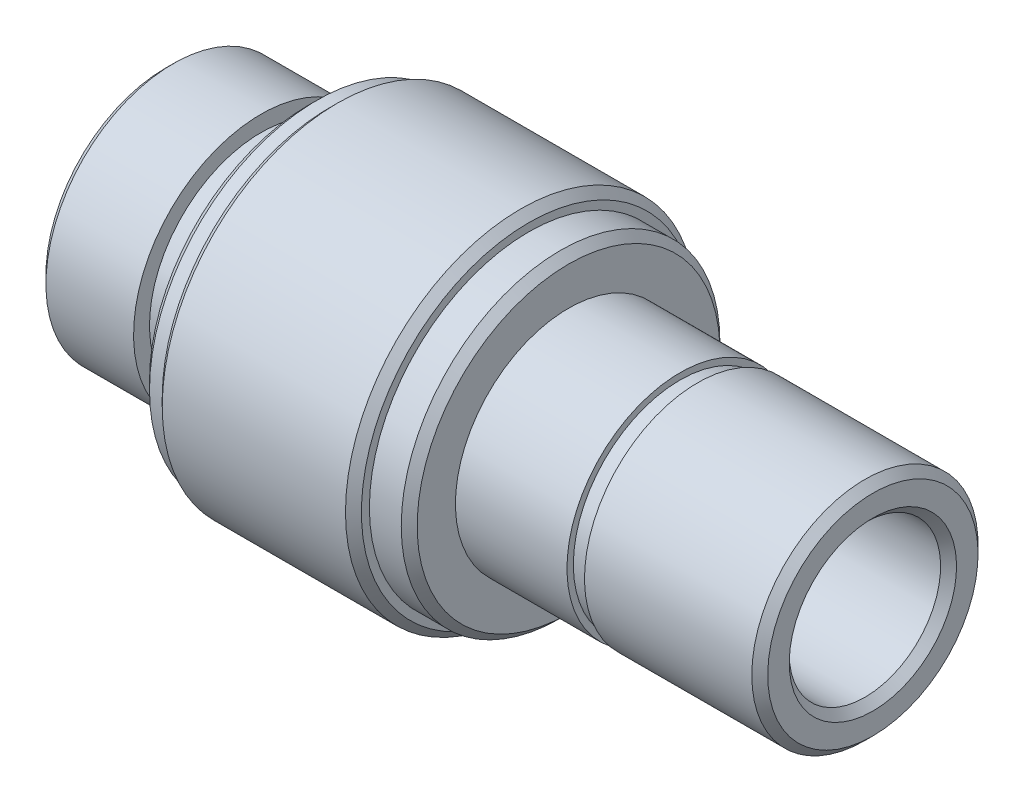
ISO-10303-21;
HEADER;
FILE_DESCRIPTION(('STEP AP214'),'2;1');
FILE_NAME('part.step','',(''),(''),'','','');
FILE_SCHEMA(('AUTOMOTIVE_DESIGN { 1 0 10303 214 1 1 1 1 }'));
ENDSEC;
DATA;
#1=APPLICATION_CONTEXT('core data for automotive mechanical design processes');
#2=APPLICATION_PROTOCOL_DEFINITION('international standard','automotive_design',2000,#1);
#3=PRODUCT_CONTEXT('',#1,'mechanical');
#4=PRODUCT('Part','Part','',(#3));
#5=PRODUCT_RELATED_PRODUCT_CATEGORY('part','',(#4));
#6=PRODUCT_DEFINITION_FORMATION('','',#4);
#7=PRODUCT_DEFINITION_CONTEXT('part definition',#1,'design');
#8=PRODUCT_DEFINITION('design','',#6,#7);
#9=PRODUCT_DEFINITION_SHAPE('','',#8);
#10=(LENGTH_UNIT() NAMED_UNIT(*) SI_UNIT(.MILLI.,.METRE.));
#11=(NAMED_UNIT(*) PLANE_ANGLE_UNIT() SI_UNIT($,.RADIAN.));
#12=(NAMED_UNIT(*) SI_UNIT($,.STERADIAN.) SOLID_ANGLE_UNIT());
#13=UNCERTAINTY_MEASURE_WITH_UNIT(LENGTH_MEASURE(1.E-05),#10,'distance_accuracy_value','');
#14=(GEOMETRIC_REPRESENTATION_CONTEXT(3) GLOBAL_UNCERTAINTY_ASSIGNED_CONTEXT((#13)) GLOBAL_UNIT_ASSIGNED_CONTEXT((#10,
#11,#12)) REPRESENTATION_CONTEXT('',''));
#15=CARTESIAN_POINT('',(0.,0.,0.));
#16=DIRECTION('',(0.,0.,1.));
#17=DIRECTION('',(1.,0.,0.));
#18=AXIS2_PLACEMENT_3D('',#15,#16,#17);
#19=CARTESIAN_POINT('',(-50.049857,-13.516816,0.));
#20=DIRECTION('',(-1.,0.,0.));
#21=DIRECTION('',(0.,-1.,0.));
#22=AXIS2_PLACEMENT_3D('',#19,#20,#21);
#23=CYLINDRICAL_SURFACE('',#22,6.7);
#24=CARTESIAN_POINT('',(-17.749857,-13.516816,0.));
#25=DIRECTION('',(-1.,0.,0.));
#26=DIRECTION('',(0.,-1.,0.));
#27=AXIS2_PLACEMENT_3D('',#24,#25,#26);
#28=CIRCLE('',#27,6.7);
#29=CARTESIAN_POINT('',(-17.749857,-20.216816,0.));
#30=VERTEX_POINT('',#29);
#31=EDGE_CURVE('E77',#30,#30,#28,.T.);
#32=ORIENTED_EDGE('',*,*,#31,.F.);
#33=EDGE_LOOP('',(#32));
#34=FACE_BOUND('',#33,.T.);
#35=CARTESIAN_POINT('',(-16.649857,-13.516816,0.));
#36=DIRECTION('',(-1.,0.,0.));
#37=DIRECTION('',(0.,-1.,0.));
#38=AXIS2_PLACEMENT_3D('',#35,#36,#37);
#39=CIRCLE('',#38,6.7);
#40=CARTESIAN_POINT('',(-16.649857,-20.216816,0.));
#41=VERTEX_POINT('',#40);
#42=EDGE_CURVE('E107',#41,#41,#39,.T.);
#43=ORIENTED_EDGE('',*,*,#42,.T.);
#44=EDGE_LOOP('',(#43));
#45=FACE_BOUND('',#44,.T.);
#46=ADVANCED_FACE('F31',(#34,#45),#23,.T.);
#47=CARTESIAN_POINT('',(-17.749857,-43.7374138503609,0.));
#48=DIRECTION('',(-1.,0.,0.));
#49=DIRECTION('',(0.,-1.,0.));
#50=AXIS2_PLACEMENT_3D('',#47,#48,#49);
#51=PLANE('',#50);
#52=CARTESIAN_POINT('',(-17.749857,-13.516816,0.));
#53=DIRECTION('',(-1.,0.,0.));
#54=DIRECTION('',(0.,-1.,0.));
#55=AXIS2_PLACEMENT_3D('',#52,#53,#54);
#56=CIRCLE('',#55,7.1);
#57=CARTESIAN_POINT('',(-17.749857,-20.616816,0.));
#58=VERTEX_POINT('',#57);
#59=EDGE_CURVE('E80',#58,#58,#56,.T.);
#60=ORIENTED_EDGE('',*,*,#59,.F.);
#61=EDGE_LOOP('',(#60));
#62=FACE_BOUND('',#61,.T.);
#63=ORIENTED_EDGE('',*,*,#31,.T.);
#64=EDGE_LOOP('',(#63));
#65=FACE_BOUND('',#64,.T.);
#66=ADVANCED_FACE('F131',(#62,#65),#51,.F.);
#67=CARTESIAN_POINT('',(-50.049857,-13.516816,0.));
#68=DIRECTION('',(-1.,0.,0.));
#69=DIRECTION('',(0.,-1.,0.));
#70=AXIS2_PLACEMENT_3D('',#67,#68,#69);
#71=CYLINDRICAL_SURFACE('',#70,7.10000000000001);
#72=CARTESIAN_POINT('',(-24.749857,-13.516816,0.));
#73=DIRECTION('',(-1.,0.,0.));
#74=DIRECTION('',(0.,-1.,0.));
#75=AXIS2_PLACEMENT_3D('',#72,#73,#74);
#76=CIRCLE('',#75,7.10000000000001);
#77=CARTESIAN_POINT('',(-24.749857,-20.616816,0.));
#78=VERTEX_POINT('',#77);
#79=EDGE_CURVE('E83',#78,#78,#76,.T.);
#80=ORIENTED_EDGE('',*,*,#79,.F.);
#81=EDGE_LOOP('',(#80));
#82=FACE_BOUND('',#81,.T.);
#83=ORIENTED_EDGE('',*,*,#59,.T.);
#84=EDGE_LOOP('',(#83));
#85=FACE_BOUND('',#84,.T.);
#86=ADVANCED_FACE('F136',(#82,#85),#71,.T.);
#87=CARTESIAN_POINT('',(-24.749857,-43.7374138503609,0.));
#88=DIRECTION('',(1.,0.,0.));
#89=DIRECTION('',(0.,1.,0.));
#90=AXIS2_PLACEMENT_3D('',#87,#88,#89);
#91=PLANE('',#90);
#92=CARTESIAN_POINT('',(-24.749857,-13.516816,0.));
#93=DIRECTION('',(1.,0.,0.));
#94=DIRECTION('',(0.,1.,0.));
#95=AXIS2_PLACEMENT_3D('',#92,#93,#94);
#96=CIRCLE('',#95,9.5);
#97=CARTESIAN_POINT('',(-24.749857,-4.016816,0.));
#98=VERTEX_POINT('',#97);
#99=EDGE_CURVE('E10',#98,#98,#96,.T.);
#100=ORIENTED_EDGE('',*,*,#99,.T.);
#101=EDGE_LOOP('',(#100));
#102=FACE_BOUND('',#101,.T.);
#103=ORIENTED_EDGE('',*,*,#79,.T.);
#104=EDGE_LOOP('',(#103));
#105=FACE_BOUND('',#104,.T.);
#106=ADVANCED_FACE('F143',(#102,#105),#91,.T.);
#107=CARTESIAN_POINT('',(-50.049857,-13.516816,0.));
#108=DIRECTION('',(-1.,0.,0.));
#109=DIRECTION('',(0.,-1.,0.));
#110=AXIS2_PLACEMENT_3D('',#107,#108,#109);
#111=CYLINDRICAL_SURFACE('',#110,10.);
#112=CARTESIAN_POINT('',(-25.249857,-13.516816,0.));
#113=DIRECTION('',(1.,0.,0.));
#114=DIRECTION('',(0.,0.,-1.));
#115=AXIS2_PLACEMENT_3D('',#112,#113,#114);
#116=CIRCLE('',#115,10.);
#117=CARTESIAN_POINT('',(-25.249857,-13.516816,-10.));
#118=VERTEX_POINT('',#117);
#119=EDGE_CURVE('E37',#118,#118,#116,.F.);
#120=ORIENTED_EDGE('',*,*,#119,.T.);
#121=EDGE_LOOP('',(#120));
#122=FACE_BOUND('',#121,.T.);
#123=CARTESIAN_POINT('',(-27.249857,-13.516816,0.));
#124=DIRECTION('',(-1.,0.,0.));
#125=DIRECTION('',(0.,-1.,0.));
#126=AXIS2_PLACEMENT_3D('',#123,#124,#125);
#127=CIRCLE('',#126,10.);
#128=CARTESIAN_POINT('',(-27.249857,-23.516816,0.));
#129=VERTEX_POINT('',#128);
#130=EDGE_CURVE('E86',#129,#129,#127,.T.);
#131=ORIENTED_EDGE('',*,*,#130,.F.);
#132=EDGE_LOOP('',(#131));
#133=FACE_BOUND('',#132,.T.);
#134=ADVANCED_FACE('F150',(#122,#133),#111,.T.);
#135=CARTESIAN_POINT('',(-27.249857,-43.7374138503609,0.));
#136=DIRECTION('',(-1.,0.,0.));
#137=DIRECTION('',(0.,-1.,0.));
#138=AXIS2_PLACEMENT_3D('',#135,#136,#137);
#139=PLANE('',#138);
#140=CARTESIAN_POINT('',(-27.249857,-13.516816,0.));
#141=DIRECTION('',(-1.,0.,0.));
#142=DIRECTION('',(0.,-1.,0.));
#143=AXIS2_PLACEMENT_3D('',#140,#141,#142);
#144=CIRCLE('',#143,10.5);
#145=CARTESIAN_POINT('',(-27.249857,-24.016816,0.));
#146=VERTEX_POINT('',#145);
#147=EDGE_CURVE('E71',#146,#146,#144,.F.);
#148=ORIENTED_EDGE('',*,*,#147,.T.);
#149=EDGE_LOOP('',(#148));
#150=FACE_BOUND('',#149,.T.);
#151=ORIENTED_EDGE('',*,*,#130,.T.);
#152=EDGE_LOOP('',(#151));
#153=FACE_BOUND('',#152,.T.);
#154=ADVANCED_FACE('F153',(#150,#153),#139,.F.);
#155=CARTESIAN_POINT('',(-50.049857,-13.516816,0.));
#156=DIRECTION('',(-1.,0.,0.));
#157=DIRECTION('',(0.,-1.,0.));
#158=AXIS2_PLACEMENT_3D('',#155,#156,#157);
#159=CYLINDRICAL_SURFACE('',#158,11.);
#160=CARTESIAN_POINT('',(-27.749857,-13.516816,0.));
#161=DIRECTION('',(-1.,0.,0.));
#162=DIRECTION('',(0.,0.,1.));
#163=AXIS2_PLACEMENT_3D('',#160,#161,#162);
#164=CIRCLE('',#163,11.);
#165=CARTESIAN_POINT('',(-27.749857,-13.516816,11.));
#166=VERTEX_POINT('',#165);
#167=EDGE_CURVE('E74',#166,#166,#164,.T.);
#168=ORIENTED_EDGE('',*,*,#167,.T.);
#169=EDGE_LOOP('',(#168));
#170=FACE_BOUND('',#169,.T.);
#171=CARTESIAN_POINT('',(-39.249857,-13.516816,0.));
#172=DIRECTION('',(-1.,0.,0.));
#173=DIRECTION('',(0.,-1.,0.));
#174=AXIS2_PLACEMENT_3D('',#171,#172,#173);
#175=CIRCLE('',#174,11.);
#176=CARTESIAN_POINT('',(-39.249857,-24.516816,0.));
#177=VERTEX_POINT('',#176);
#178=EDGE_CURVE('E89',#177,#177,#175,.T.);
#179=ORIENTED_EDGE('',*,*,#178,.F.);
#180=EDGE_LOOP('',(#179));
#181=FACE_BOUND('',#180,.T.);
#182=ADVANCED_FACE('F156',(#170,#181),#159,.T.);
#183=CARTESIAN_POINT('',(-50.049857,-13.516816,0.));
#184=DIRECTION('',(-1.,0.,0.));
#185=DIRECTION('',(0.,-1.,0.));
#186=AXIS2_PLACEMENT_3D('',#183,#184,#185);
#187=CYLINDRICAL_SURFACE('',#186,10.5);
#188=CARTESIAN_POINT('',(-40.549857,-13.516816,0.));
#189=DIRECTION('',(-1.,0.,0.));
#190=DIRECTION('',(0.,0.,1.));
#191=AXIS2_PLACEMENT_3D('',#188,#189,#190);
#192=CIRCLE('',#191,10.5);
#193=CARTESIAN_POINT('',(-40.549857,-13.516816,10.5));
#194=VERTEX_POINT('',#193);
#195=EDGE_CURVE('E62',#194,#194,#192,.F.);
#196=ORIENTED_EDGE('',*,*,#195,.T.);
#197=EDGE_LOOP('',(#196));
#198=FACE_BOUND('',#197,.T.);
#199=CARTESIAN_POINT('',(-39.749857,-13.516816,0.));
#200=DIRECTION('',(1.,0.,0.));
#201=DIRECTION('',(0.,0.,-1.));
#202=AXIS2_PLACEMENT_3D('',#199,#200,#201);
#203=CIRCLE('',#202,10.5);
#204=CARTESIAN_POINT('',(-39.749857,-13.516816,-10.5));
#205=VERTEX_POINT('',#204);
#206=EDGE_CURVE('E65',#205,#205,#203,.F.);
#207=ORIENTED_EDGE('',*,*,#206,.T.);
#208=EDGE_LOOP('',(#207));
#209=FACE_BOUND('',#208,.T.);
#210=ADVANCED_FACE('F160',(#198,#209),#187,.T.);
#211=CARTESIAN_POINT('',(-41.049857,-43.7374138503609,0.));
#212=DIRECTION('',(-1.,0.,0.));
#213=DIRECTION('',(0.,-1.,0.));
#214=AXIS2_PLACEMENT_3D('',#211,#212,#213);
#215=PLANE('',#214);
#216=CARTESIAN_POINT('',(-41.049857,-13.516816,0.));
#217=DIRECTION('',(-1.,0.,0.));
#218=DIRECTION('',(0.,-1.,0.));
#219=AXIS2_PLACEMENT_3D('',#216,#217,#218);
#220=CIRCLE('',#219,10.);
#221=CARTESIAN_POINT('',(-41.049857,-23.516816,0.));
#222=VERTEX_POINT('',#221);
#223=EDGE_CURVE('E68',#222,#222,#220,.T.);
#224=ORIENTED_EDGE('',*,*,#223,.T.);
#225=EDGE_LOOP('',(#224));
#226=FACE_BOUND('',#225,.T.);
#227=CARTESIAN_POINT('',(-41.049857,-13.516816,0.));
#228=DIRECTION('',(-1.,0.,0.));
#229=DIRECTION('',(0.,-1.,0.));
#230=AXIS2_PLACEMENT_3D('',#227,#228,#229);
#231=CIRCLE('',#230,7.);
#232=CARTESIAN_POINT('',(-41.049857,-20.516816,0.));
#233=VERTEX_POINT('',#232);
#234=EDGE_CURVE('E92',#233,#233,#231,.T.);
#235=ORIENTED_EDGE('',*,*,#234,.F.);
#236=EDGE_LOOP('',(#235));
#237=FACE_BOUND('',#236,.T.);
#238=ADVANCED_FACE('F164',(#226,#237),#215,.T.);
#239=CARTESIAN_POINT('',(-50.049857,-13.516816,0.));
#240=DIRECTION('',(-1.,0.,0.));
#241=DIRECTION('',(0.,-1.,0.));
#242=AXIS2_PLACEMENT_3D('',#239,#240,#241);
#243=CYLINDRICAL_SURFACE('',#242,7.);
#244=ORIENTED_EDGE('',*,*,#234,.T.);
#245=EDGE_LOOP('',(#244));
#246=FACE_BOUND('',#245,.T.);
#247=CARTESIAN_POINT('',(-44.049857,-13.516816,0.));
#248=DIRECTION('',(-1.,0.,0.));
#249=DIRECTION('',(0.,-1.,0.));
#250=AXIS2_PLACEMENT_3D('',#247,#248,#249);
#251=CIRCLE('',#250,7.);
#252=CARTESIAN_POINT('',(-44.049857,-20.516816,0.));
#253=VERTEX_POINT('',#252);
#254=EDGE_CURVE('E95',#253,#253,#251,.T.);
#255=ORIENTED_EDGE('',*,*,#254,.F.);
#256=EDGE_LOOP('',(#255));
#257=FACE_BOUND('',#256,.T.);
#258=ADVANCED_FACE('F168',(#246,#257),#243,.T.);
#259=CARTESIAN_POINT('',(-44.049857,-43.7374138503609,0.));
#260=DIRECTION('',(1.,0.,0.));
#261=DIRECTION('',(0.,1.,0.));
#262=AXIS2_PLACEMENT_3D('',#259,#260,#261);
#263=PLANE('',#262);
#264=ORIENTED_EDGE('',*,*,#254,.T.);
#265=EDGE_LOOP('',(#264));
#266=FACE_BOUND('',#265,.T.);
#267=CARTESIAN_POINT('',(-44.049857,-13.516816,0.));
#268=DIRECTION('',(-1.,0.,0.));
#269=DIRECTION('',(0.,-1.,0.));
#270=AXIS2_PLACEMENT_3D('',#267,#268,#269);
#271=CIRCLE('',#270,7.99999999999999);
#272=CARTESIAN_POINT('',(-44.049857,-21.516816,0.));
#273=VERTEX_POINT('',#272);
#274=EDGE_CURVE('E98',#273,#273,#271,.T.);
#275=ORIENTED_EDGE('',*,*,#274,.F.);
#276=EDGE_LOOP('',(#275));
#277=FACE_BOUND('',#276,.T.);
#278=ADVANCED_FACE('F172',(#266,#277),#263,.T.);
#279=CARTESIAN_POINT('',(-50.049857,-13.516816,0.));
#280=DIRECTION('',(-1.,0.,0.));
#281=DIRECTION('',(0.,-1.,0.));
#282=AXIS2_PLACEMENT_3D('',#279,#280,#281);
#283=CYLINDRICAL_SURFACE('',#282,8.);
#284=CARTESIAN_POINT('',(-49.549857,-13.516816,0.));
#285=DIRECTION('',(1.,0.,0.));
#286=DIRECTION('',(0.,0.,-1.));
#287=AXIS2_PLACEMENT_3D('',#284,#285,#286);
#288=CIRCLE('',#287,8.);
#289=CARTESIAN_POINT('',(-49.549857,-13.516816,-8.));
#290=VERTEX_POINT('',#289);
#291=EDGE_CURVE('E41',#290,#290,#288,.T.);
#292=ORIENTED_EDGE('',*,*,#291,.T.);
#293=EDGE_LOOP('',(#292));
#294=FACE_BOUND('',#293,.T.);
#295=ORIENTED_EDGE('',*,*,#274,.T.);
#296=EDGE_LOOP('',(#295));
#297=FACE_BOUND('',#296,.T.);
#298=ADVANCED_FACE('F176',(#294,#297),#283,.T.);
#299=CARTESIAN_POINT('',(-50.049857,-43.7374138503609,0.));
#300=DIRECTION('',(1.,0.,0.));
#301=DIRECTION('',(0.,1.,0.));
#302=AXIS2_PLACEMENT_3D('',#299,#300,#301);
#303=PLANE('',#302);
#304=CARTESIAN_POINT('',(-50.049857,-13.516816,0.));
#305=DIRECTION('',(1.,0.,0.));
#306=DIRECTION('',(0.,1.,0.));
#307=AXIS2_PLACEMENT_3D('',#304,#305,#306);
#308=CIRCLE('',#307,7.49999999999999);
#309=CARTESIAN_POINT('',(-50.049857,-6.016816,0.));
#310=VERTEX_POINT('',#309);
#311=EDGE_CURVE('E45',#310,#310,#308,.F.);
#312=ORIENTED_EDGE('',*,*,#311,.T.);
#313=EDGE_LOOP('',(#312));
#314=FACE_BOUND('',#313,.T.);
#315=CARTESIAN_POINT('',(-50.049857,-13.516816,0.));
#316=DIRECTION('',(-1.,0.,0.));
#317=DIRECTION('',(0.,-1.,0.));
#318=AXIS2_PLACEMENT_3D('',#315,#316,#317);
#319=CIRCLE('',#318,4.75000000000001);
#320=CARTESIAN_POINT('',(-50.049857,-18.266816,0.));
#321=VERTEX_POINT('',#320);
#322=EDGE_CURVE('E101',#321,#321,#319,.T.);
#323=ORIENTED_EDGE('',*,*,#322,.F.);
#324=EDGE_LOOP('',(#323));
#325=FACE_BOUND('',#324,.T.);
#326=ADVANCED_FACE('F180',(#314,#325),#303,.F.);
#327=CARTESIAN_POINT('',(-50.049857,-13.516816,0.));
#328=DIRECTION('',(-1.,0.,0.));
#329=DIRECTION('',(0.,-1.,0.));
#330=AXIS2_PLACEMENT_3D('',#327,#328,#329);
#331=CYLINDRICAL_SURFACE('',#330,4.75);
#332=CARTESIAN_POINT('',(-6.149857,-13.516816,0.));
#333=DIRECTION('',(-1.,0.,0.));
#334=DIRECTION('',(0.,0.,1.));
#335=AXIS2_PLACEMENT_3D('',#332,#333,#334);
#336=CIRCLE('',#335,4.75);
#337=CARTESIAN_POINT('',(-6.149857,-13.516816,4.75));
#338=VERTEX_POINT('',#337);
#339=EDGE_CURVE('E53',#338,#338,#336,.F.);
#340=ORIENTED_EDGE('',*,*,#339,.T.);
#341=EDGE_LOOP('',(#340));
#342=FACE_BOUND('',#341,.T.);
#343=ORIENTED_EDGE('',*,*,#322,.T.);
#344=EDGE_LOOP('',(#343));
#345=FACE_BOUND('',#344,.T.);
#346=ADVANCED_FACE('F127',(#342,#345),#331,.F.);
#347=CARTESIAN_POINT('',(-5.64985699999999,-43.7374138503609,0.));
#348=DIRECTION('',(-1.,0.,0.));
#349=DIRECTION('',(0.,-1.,0.));
#350=AXIS2_PLACEMENT_3D('',#347,#348,#349);
#351=PLANE('',#350);
#352=CARTESIAN_POINT('',(-5.649857,-13.516816,0.));
#353=DIRECTION('',(-1.,0.,0.));
#354=DIRECTION('',(0.,-1.,0.));
#355=AXIS2_PLACEMENT_3D('',#352,#353,#354);
#356=CIRCLE('',#355,5.25);
#357=CARTESIAN_POINT('',(-5.649857,-18.766816,0.));
#358=VERTEX_POINT('',#357);
#359=EDGE_CURVE('E56',#358,#358,#356,.T.);
#360=ORIENTED_EDGE('',*,*,#359,.T.);
#361=EDGE_LOOP('',(#360));
#362=FACE_BOUND('',#361,.T.);
#363=CARTESIAN_POINT('',(-5.649857,-13.516816,0.));
#364=DIRECTION('',(-1.,0.,0.));
#365=DIRECTION('',(0.,-1.,0.));
#366=AXIS2_PLACEMENT_3D('',#363,#364,#365);
#367=CIRCLE('',#366,6.59999999999999);
#368=CARTESIAN_POINT('',(-5.649857,-20.116816,0.));
#369=VERTEX_POINT('',#368);
#370=EDGE_CURVE('E59',#369,#369,#367,.F.);
#371=ORIENTED_EDGE('',*,*,#370,.T.);
#372=EDGE_LOOP('',(#371));
#373=FACE_BOUND('',#372,.T.);
#374=ADVANCED_FACE('F121',(#362,#373),#351,.F.);
#375=CARTESIAN_POINT('',(-50.049857,-13.516816,0.));
#376=DIRECTION('',(-1.,0.,0.));
#377=DIRECTION('',(0.,-1.,0.));
#378=AXIS2_PLACEMENT_3D('',#375,#376,#377);
#379=CYLINDRICAL_SURFACE('',#378,7.1);
#380=CARTESIAN_POINT('',(-6.149857,-13.516816,0.));
#381=DIRECTION('',(-1.,0.,0.));
#382=DIRECTION('',(0.,0.,1.));
#383=AXIS2_PLACEMENT_3D('',#380,#381,#382);
#384=CIRCLE('',#383,7.1);
#385=CARTESIAN_POINT('',(-6.149857,-13.516816,7.1));
#386=VERTEX_POINT('',#385);
#387=EDGE_CURVE('E50',#386,#386,#384,.T.);
#388=ORIENTED_EDGE('',*,*,#387,.T.);
#389=EDGE_LOOP('',(#388));
#390=FACE_BOUND('',#389,.T.);
#391=CARTESIAN_POINT('',(-16.649857,-13.516816,0.));
#392=DIRECTION('',(-1.,0.,0.));
#393=DIRECTION('',(0.,-1.,0.));
#394=AXIS2_PLACEMENT_3D('',#391,#392,#393);
#395=CIRCLE('',#394,7.1);
#396=CARTESIAN_POINT('',(-16.649857,-20.616816,0.));
#397=VERTEX_POINT('',#396);
#398=EDGE_CURVE('E104',#397,#397,#395,.T.);
#399=ORIENTED_EDGE('',*,*,#398,.F.);
#400=EDGE_LOOP('',(#399));
#401=FACE_BOUND('',#400,.T.);
#402=ADVANCED_FACE('F116',(#390,#401),#379,.T.);
#403=CARTESIAN_POINT('',(-16.649857,-43.7374138503609,0.));
#404=DIRECTION('',(1.,0.,0.));
#405=DIRECTION('',(0.,1.,0.));
#406=AXIS2_PLACEMENT_3D('',#403,#404,#405);
#407=PLANE('',#406);
#408=ORIENTED_EDGE('',*,*,#42,.F.);
#409=EDGE_LOOP('',(#408));
#410=FACE_BOUND('',#409,.T.);
#411=ORIENTED_EDGE('',*,*,#398,.T.);
#412=EDGE_LOOP('',(#411));
#413=FACE_BOUND('',#412,.T.);
#414=ADVANCED_FACE('F112',(#410,#413),#407,.F.);
#415=CARTESIAN_POINT('',(-27.749857,-13.516816,0.));
#416=DIRECTION('',(-1.,0.,0.));
#417=DIRECTION('',(0.,0.,1.));
#418=AXIS2_PLACEMENT_3D('',#415,#416,#417);
#419=CONICAL_SURFACE('',#418,11.,0.785398163397445);
#420=ORIENTED_EDGE('',*,*,#147,.F.);
#421=EDGE_LOOP('',(#420));
#422=FACE_BOUND('',#421,.T.);
#423=ORIENTED_EDGE('',*,*,#167,.F.);
#424=EDGE_LOOP('',(#423));
#425=FACE_BOUND('',#424,.T.);
#426=ADVANCED_FACE('F115',(#422,#425),#419,.T.);
#427=CARTESIAN_POINT('',(-41.049857,-13.516816,0.));
#428=DIRECTION('',(1.,0.,0.));
#429=DIRECTION('',(0.,0.,-1.));
#430=AXIS2_PLACEMENT_3D('',#427,#428,#429);
#431=CONICAL_SURFACE('',#430,9.99999999999999,0.785398163397447);
#432=ORIENTED_EDGE('',*,*,#195,.F.);
#433=EDGE_LOOP('',(#432));
#434=FACE_BOUND('',#433,.T.);
#435=ORIENTED_EDGE('',*,*,#223,.F.);
#436=EDGE_LOOP('',(#435));
#437=FACE_BOUND('',#436,.T.);
#438=ADVANCED_FACE('F219',(#434,#437),#431,.T.);
#439=CARTESIAN_POINT('',(-39.749857,-13.516816,0.));
#440=DIRECTION('',(1.,0.,0.));
#441=DIRECTION('',(0.,0.,-1.));
#442=AXIS2_PLACEMENT_3D('',#439,#440,#441);
#443=CONICAL_SURFACE('',#442,10.5,0.78539816339745);
#444=ORIENTED_EDGE('',*,*,#178,.T.);
#445=EDGE_LOOP('',(#444));
#446=FACE_BOUND('',#445,.T.);
#447=ORIENTED_EDGE('',*,*,#206,.F.);
#448=EDGE_LOOP('',(#447));
#449=FACE_BOUND('',#448,.T.);
#450=ADVANCED_FACE('F198',(#446,#449),#443,.T.);
#451=CARTESIAN_POINT('',(-5.649857,-13.516816,0.));
#452=DIRECTION('',(1.,0.,0.));
#453=DIRECTION('',(0.,0.,-1.));
#454=AXIS2_PLACEMENT_3D('',#451,#452,#453);
#455=CONICAL_SURFACE('',#454,5.25,0.785398163397445);
#456=ORIENTED_EDGE('',*,*,#339,.F.);
#457=EDGE_LOOP('',(#456));
#458=FACE_BOUND('',#457,.T.);
#459=ORIENTED_EDGE('',*,*,#359,.F.);
#460=EDGE_LOOP('',(#459));
#461=FACE_BOUND('',#460,.T.);
#462=ADVANCED_FACE('F194',(#458,#461),#455,.F.);
#463=CARTESIAN_POINT('',(-6.149857,-13.516816,0.));
#464=DIRECTION('',(-1.,0.,0.));
#465=DIRECTION('',(0.,0.,1.));
#466=AXIS2_PLACEMENT_3D('',#463,#464,#465);
#467=CONICAL_SURFACE('',#466,7.1,0.785398163397449);
#468=ORIENTED_EDGE('',*,*,#370,.F.);
#469=EDGE_LOOP('',(#468));
#470=FACE_BOUND('',#469,.T.);
#471=ORIENTED_EDGE('',*,*,#387,.F.);
#472=EDGE_LOOP('',(#471));
#473=FACE_BOUND('',#472,.T.);
#474=ADVANCED_FACE('F197',(#470,#473),#467,.T.);
#475=CARTESIAN_POINT('',(-50.049857,-13.516816,0.));
#476=DIRECTION('',(1.,0.,0.));
#477=DIRECTION('',(0.,0.,-1.));
#478=AXIS2_PLACEMENT_3D('',#475,#476,#477);
#479=CONICAL_SURFACE('',#478,7.49999999999999,0.785398163397452);
#480=ORIENTED_EDGE('',*,*,#291,.F.);
#481=EDGE_LOOP('',(#480));
#482=FACE_BOUND('',#481,.T.);
#483=ORIENTED_EDGE('',*,*,#311,.F.);
#484=EDGE_LOOP('',(#483));
#485=FACE_BOUND('',#484,.T.);
#486=ADVANCED_FACE('F206',(#482,#485),#479,.T.);
#487=CARTESIAN_POINT('',(-25.249857,-13.516816,0.));
#488=DIRECTION('',(-1.,0.,0.));
#489=DIRECTION('',(0.,0.,1.));
#490=AXIS2_PLACEMENT_3D('',#487,#488,#489);
#491=CONICAL_SURFACE('',#490,10.,0.785398163397448);
#492=ORIENTED_EDGE('',*,*,#99,.F.);
#493=EDGE_LOOP('',(#492));
#494=FACE_BOUND('',#493,.T.);
#495=ORIENTED_EDGE('',*,*,#119,.F.);
#496=EDGE_LOOP('',(#495));
#497=FACE_BOUND('',#496,.T.);
#498=ADVANCED_FACE('F212',(#494,#497),#491,.T.);
#499=CLOSED_SHELL('',(#46,#66,#86,#106,#134,#154,#182,#210,#238,#258,#278,#298,#326,#346,#374,
#402,#414,#426,#438,#450,#462,#474,#486,#498));
#500=MANIFOLD_SOLID_BREP('B2',#499);
#501=ADVANCED_BREP_SHAPE_REPRESENTATION('',(#18,#500),#14);
#502=SHAPE_DEFINITION_REPRESENTATION(#9,#501);
ENDSEC;
END-ISO-10303-21;
